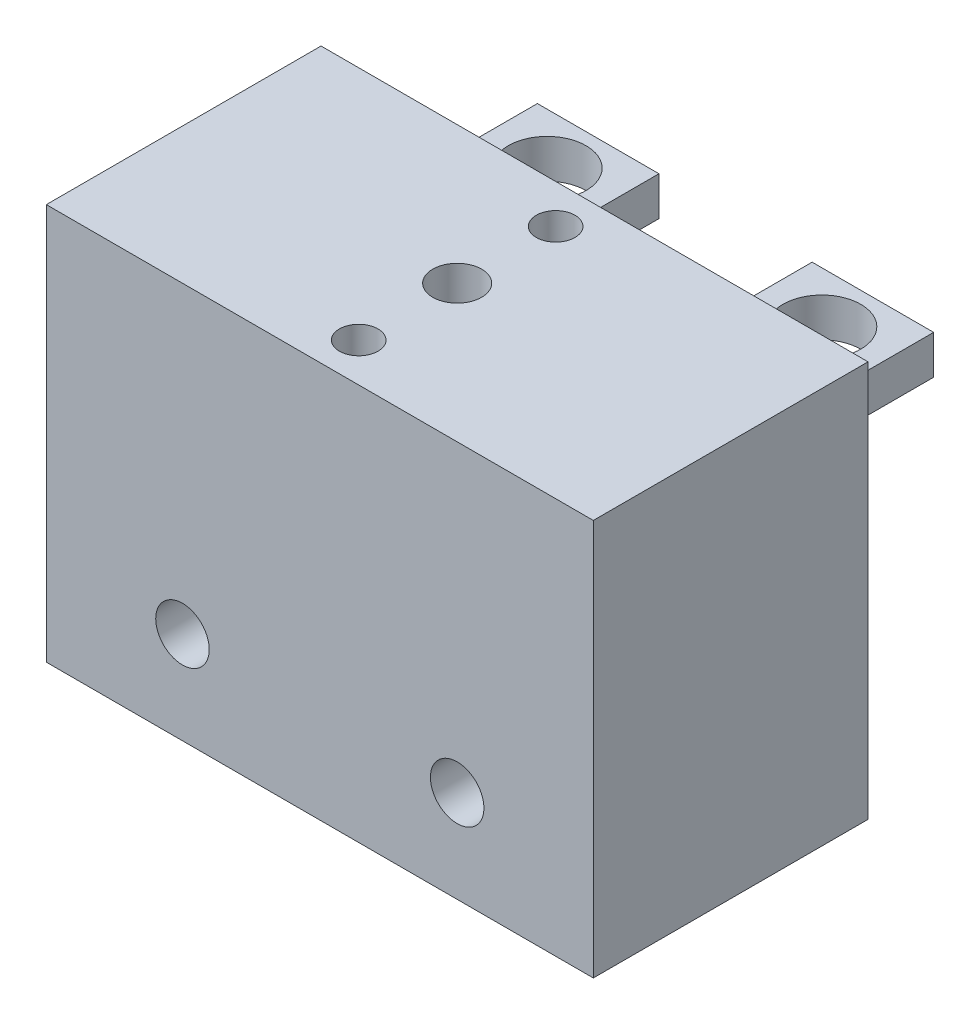
ISO-10303-21;
HEADER;
FILE_DESCRIPTION(('STEP AP214'),'2;1');
FILE_NAME('part.step','',(''),(''),'','','');
FILE_SCHEMA(('AUTOMOTIVE_DESIGN { 1 0 10303 214 1 1 1 1 }'));
ENDSEC;
DATA;
#1=APPLICATION_CONTEXT('core data for automotive mechanical design processes');
#2=APPLICATION_PROTOCOL_DEFINITION('international standard','automotive_design',2000,#1);
#3=PRODUCT_CONTEXT('',#1,'mechanical');
#4=PRODUCT('Part','Part','',(#3));
#5=PRODUCT_RELATED_PRODUCT_CATEGORY('part','',(#4));
#6=PRODUCT_DEFINITION_FORMATION('','',#4);
#7=PRODUCT_DEFINITION_CONTEXT('part definition',#1,'design');
#8=PRODUCT_DEFINITION('design','',#6,#7);
#9=PRODUCT_DEFINITION_SHAPE('','',#8);
#10=(LENGTH_UNIT() NAMED_UNIT(*) SI_UNIT(.MILLI.,.METRE.));
#11=(NAMED_UNIT(*) PLANE_ANGLE_UNIT() SI_UNIT($,.RADIAN.));
#12=(NAMED_UNIT(*) SI_UNIT($,.STERADIAN.) SOLID_ANGLE_UNIT());
#13=UNCERTAINTY_MEASURE_WITH_UNIT(LENGTH_MEASURE(1.E-05),#10,'distance_accuracy_value','');
#14=(GEOMETRIC_REPRESENTATION_CONTEXT(3) GLOBAL_UNCERTAINTY_ASSIGNED_CONTEXT((#13)) GLOBAL_UNIT_ASSIGNED_CONTEXT((#10,
#11,#12)) REPRESENTATION_CONTEXT('',''));
#15=CARTESIAN_POINT('',(0.,0.,0.));
#16=DIRECTION('',(0.,0.,1.));
#17=DIRECTION('',(1.,0.,0.));
#18=AXIS2_PLACEMENT_3D('',#15,#16,#17);
#19=CARTESIAN_POINT('',(0.,41.402,-28.702));
#20=DIRECTION('',(0.,0.,1.));
#21=DIRECTION('',(1.,0.,0.));
#22=AXIS2_PLACEMENT_3D('',#19,#20,#21);
#23=PLANE('',#22);
#24=DIRECTION('',(0.,-1.,0.));
#25=VECTOR('',#24,1.);
#26=CARTESIAN_POINT('',(49.276,32.766,-28.702));
#27=LINE('',#26,#25);
#28=CARTESIAN_POINT('',(49.276,32.766,-28.702));
#29=VERTEX_POINT('',#28);
#30=CARTESIAN_POINT('',(49.276,28.702,-28.702));
#31=VERTEX_POINT('',#30);
#32=EDGE_CURVE('E152',#29,#31,#27,.T.);
#33=ORIENTED_EDGE('',*,*,#32,.F.);
#34=DIRECTION('',(1.,0.,0.));
#35=VECTOR('',#34,1.);
#36=CARTESIAN_POINT('',(49.276,32.766,-28.702));
#37=LINE('',#36,#35);
#38=CARTESIAN_POINT('',(36.576,32.766,-28.702));
#39=VERTEX_POINT('',#38);
#40=EDGE_CURVE('E161',#39,#29,#37,.T.);
#41=ORIENTED_EDGE('',*,*,#40,.F.);
#42=DIRECTION('',(0.,1.,0.));
#43=VECTOR('',#42,1.);
#44=CARTESIAN_POINT('',(36.576,32.766,-28.702));
#45=LINE('',#44,#43);
#46=CARTESIAN_POINT('',(36.576,28.702,-28.702));
#47=VERTEX_POINT('',#46);
#48=EDGE_CURVE('E158',#47,#39,#45,.T.);
#49=ORIENTED_EDGE('',*,*,#48,.F.);
#50=DIRECTION('',(-1.,0.,0.));
#51=VECTOR('',#50,1.);
#52=CARTESIAN_POINT('',(49.276,28.702,-28.702));
#53=LINE('',#52,#51);
#54=EDGE_CURVE('E155',#31,#47,#53,.T.);
#55=ORIENTED_EDGE('',*,*,#54,.F.);
#56=EDGE_LOOP('',(#33,#41,#49,#55));
#57=FACE_BOUND('',#56,.T.);
#58=CARTESIAN_POINT('',(14.224,9.65199999999999,-28.702));
#59=DIRECTION('',(0.,0.,-1.));
#60=DIRECTION('',(-1.,0.,0.));
#61=AXIS2_PLACEMENT_3D('',#58,#59,#60);
#62=CIRCLE('',#61,2.794);
#63=CARTESIAN_POINT('',(11.43,9.65199999999999,-28.702));
#64=VERTEX_POINT('',#63);
#65=EDGE_CURVE('E185',#64,#64,#62,.T.);
#66=ORIENTED_EDGE('',*,*,#65,.F.);
#67=EDGE_LOOP('',(#66));
#68=FACE_BOUND('',#67,.T.);
#69=CARTESIAN_POINT('',(42.926,9.65199999999999,-28.702));
#70=DIRECTION('',(0.,0.,-1.));
#71=DIRECTION('',(-1.,0.,0.));
#72=AXIS2_PLACEMENT_3D('',#69,#70,#71);
#73=CIRCLE('',#72,2.794);
#74=CARTESIAN_POINT('',(40.132,9.65199999999999,-28.702));
#75=VERTEX_POINT('',#74);
#76=EDGE_CURVE('E191',#75,#75,#73,.T.);
#77=ORIENTED_EDGE('',*,*,#76,.F.);
#78=EDGE_LOOP('',(#77));
#79=FACE_BOUND('',#78,.T.);
#80=DIRECTION('',(-1.,0.,0.));
#81=VECTOR('',#80,1.);
#82=CARTESIAN_POINT('',(0.,0.,-28.702));
#83=LINE('',#82,#81);
#84=CARTESIAN_POINT('',(57.15,0.,-28.702));
#85=VERTEX_POINT('',#84);
#86=CARTESIAN_POINT('',(0.,0.,-28.702));
#87=VERTEX_POINT('',#86);
#88=EDGE_CURVE('E222',#85,#87,#83,.T.);
#89=ORIENTED_EDGE('',*,*,#88,.T.);
#90=DIRECTION('',(0.,-1.,0.));
#91=VECTOR('',#90,1.);
#92=CARTESIAN_POINT('',(0.,41.402,-28.702));
#93=LINE('',#92,#91);
#94=CARTESIAN_POINT('',(0.,41.402,-28.702));
#95=VERTEX_POINT('',#94);
#96=EDGE_CURVE('E233',#95,#87,#93,.T.);
#97=ORIENTED_EDGE('',*,*,#96,.F.);
#98=DIRECTION('',(-1.,0.,0.));
#99=VECTOR('',#98,1.);
#100=CARTESIAN_POINT('',(0.,41.402,-28.702));
#101=LINE('',#100,#99);
#102=CARTESIAN_POINT('',(57.15,41.402,-28.702));
#103=VERTEX_POINT('',#102);
#104=EDGE_CURVE('E231',#103,#95,#101,.T.);
#105=ORIENTED_EDGE('',*,*,#104,.F.);
#106=DIRECTION('',(0.,-1.,0.));
#107=VECTOR('',#106,1.);
#108=CARTESIAN_POINT('',(57.15,41.402,-28.702));
#109=LINE('',#108,#107);
#110=EDGE_CURVE('E236',#103,#85,#109,.T.);
#111=ORIENTED_EDGE('',*,*,#110,.T.);
#112=EDGE_LOOP('',(#89,#97,#105,#111));
#113=FACE_BOUND('',#112,.T.);
#114=DIRECTION('',(0.,-1.,0.));
#115=VECTOR('',#114,1.);
#116=CARTESIAN_POINT('',(20.574,32.766,-28.702));
#117=LINE('',#116,#115);
#118=CARTESIAN_POINT('',(20.574,32.766,-28.702));
#119=VERTEX_POINT('',#118);
#120=CARTESIAN_POINT('',(20.574,28.702,-28.702));
#121=VERTEX_POINT('',#120);
#122=EDGE_CURVE('E119',#119,#121,#117,.T.);
#123=ORIENTED_EDGE('',*,*,#122,.F.);
#124=DIRECTION('',(1.,0.,0.));
#125=VECTOR('',#124,1.);
#126=CARTESIAN_POINT('',(20.574,32.766,-28.702));
#127=LINE('',#126,#125);
#128=CARTESIAN_POINT('',(7.874,32.766,-28.702));
#129=VERTEX_POINT('',#128);
#130=EDGE_CURVE('E121',#129,#119,#127,.T.);
#131=ORIENTED_EDGE('',*,*,#130,.F.);
#132=DIRECTION('',(0.,1.,0.));
#133=VECTOR('',#132,1.);
#134=CARTESIAN_POINT('',(7.874,32.766,-28.702));
#135=LINE('',#134,#133);
#136=CARTESIAN_POINT('',(7.874,28.702,-28.702));
#137=VERTEX_POINT('',#136);
#138=EDGE_CURVE('E54',#137,#129,#135,.T.);
#139=ORIENTED_EDGE('',*,*,#138,.F.);
#140=DIRECTION('',(-1.,0.,0.));
#141=VECTOR('',#140,1.);
#142=CARTESIAN_POINT('',(20.574,28.702,-28.702));
#143=LINE('',#142,#141);
#144=EDGE_CURVE('E49',#121,#137,#143,.T.);
#145=ORIENTED_EDGE('',*,*,#144,.F.);
#146=EDGE_LOOP('',(#123,#131,#139,#145));
#147=FACE_BOUND('',#146,.T.);
#148=ADVANCED_FACE('F34',(#57,#68,#79,#113,#147),#23,.F.);
#149=CARTESIAN_POINT('',(0.,41.402,0.));
#150=DIRECTION('',(1.,0.,0.));
#151=DIRECTION('',(0.,0.,-1.));
#152=AXIS2_PLACEMENT_3D('',#149,#150,#151);
#153=PLANE('',#152);
#154=DIRECTION('',(0.,0.,1.));
#155=VECTOR('',#154,1.);
#156=CARTESIAN_POINT('',(0.,0.,0.));
#157=LINE('',#156,#155);
#158=CARTESIAN_POINT('',(0.,0.,0.));
#159=VERTEX_POINT('',#158);
#160=EDGE_CURVE('E215',#87,#159,#157,.T.);
#161=ORIENTED_EDGE('',*,*,#160,.T.);
#162=DIRECTION('',(0.,-1.,0.));
#163=VECTOR('',#162,1.);
#164=CARTESIAN_POINT('',(0.,41.402,0.));
#165=LINE('',#164,#163);
#166=CARTESIAN_POINT('',(0.,41.402,0.));
#167=VERTEX_POINT('',#166);
#168=EDGE_CURVE('E11',#167,#159,#165,.T.);
#169=ORIENTED_EDGE('',*,*,#168,.F.);
#170=DIRECTION('',(0.,0.,1.));
#171=VECTOR('',#170,1.);
#172=CARTESIAN_POINT('',(0.,41.402,0.));
#173=LINE('',#172,#171);
#174=EDGE_CURVE('E224',#95,#167,#173,.T.);
#175=ORIENTED_EDGE('',*,*,#174,.F.);
#176=ORIENTED_EDGE('',*,*,#96,.T.);
#177=EDGE_LOOP('',(#161,#169,#175,#176));
#178=FACE_BOUND('',#177,.T.);
#179=ADVANCED_FACE('F36',(#178),#153,.F.);
#180=CARTESIAN_POINT('',(0.,41.402,0.));
#181=DIRECTION('',(0.,0.,-1.));
#182=DIRECTION('',(-1.,0.,0.));
#183=AXIS2_PLACEMENT_3D('',#180,#181,#182);
#184=PLANE('',#183);
#185=CARTESIAN_POINT('',(14.224,9.65199999999999,0.));
#186=DIRECTION('',(0.,0.,-1.));
#187=DIRECTION('',(-1.,0.,0.));
#188=AXIS2_PLACEMENT_3D('',#185,#186,#187);
#189=CIRCLE('',#188,2.794);
#190=CARTESIAN_POINT('',(11.43,9.65199999999999,0.));
#191=VERTEX_POINT('',#190);
#192=EDGE_CURVE('E188',#191,#191,#189,.T.);
#193=ORIENTED_EDGE('',*,*,#192,.T.);
#194=EDGE_LOOP('',(#193));
#195=FACE_BOUND('',#194,.T.);
#196=CARTESIAN_POINT('',(42.926,9.65199999999999,0.));
#197=DIRECTION('',(0.,0.,-1.));
#198=DIRECTION('',(-1.,0.,0.));
#199=AXIS2_PLACEMENT_3D('',#196,#197,#198);
#200=CIRCLE('',#199,2.794);
#201=CARTESIAN_POINT('',(40.132,9.65199999999999,0.));
#202=VERTEX_POINT('',#201);
#203=EDGE_CURVE('E194',#202,#202,#200,.T.);
#204=ORIENTED_EDGE('',*,*,#203,.T.);
#205=EDGE_LOOP('',(#204));
#206=FACE_BOUND('',#205,.T.);
#207=DIRECTION('',(1.,0.,0.));
#208=VECTOR('',#207,1.);
#209=CARTESIAN_POINT('',(0.,0.,0.));
#210=LINE('',#209,#208);
#211=CARTESIAN_POINT('',(57.15,0.,0.));
#212=VERTEX_POINT('',#211);
#213=EDGE_CURVE('E218',#159,#212,#210,.T.);
#214=ORIENTED_EDGE('',*,*,#213,.T.);
#215=DIRECTION('',(0.,-1.,0.));
#216=VECTOR('',#215,1.);
#217=CARTESIAN_POINT('',(57.15,41.402,0.));
#218=LINE('',#217,#216);
#219=CARTESIAN_POINT('',(57.15,41.402,0.));
#220=VERTEX_POINT('',#219);
#221=EDGE_CURVE('E42',#220,#212,#218,.T.);
#222=ORIENTED_EDGE('',*,*,#221,.F.);
#223=DIRECTION('',(1.,0.,0.));
#224=VECTOR('',#223,1.);
#225=CARTESIAN_POINT('',(0.,41.402,0.));
#226=LINE('',#225,#224);
#227=EDGE_CURVE('E227',#167,#220,#226,.T.);
#228=ORIENTED_EDGE('',*,*,#227,.F.);
#229=ORIENTED_EDGE('',*,*,#168,.T.);
#230=EDGE_LOOP('',(#214,#222,#228,#229));
#231=FACE_BOUND('',#230,.T.);
#232=ADVANCED_FACE('F258',(#195,#206,#231),#184,.F.);
#233=CARTESIAN_POINT('',(57.15,41.402,0.));
#234=DIRECTION('',(-1.,0.,0.));
#235=DIRECTION('',(0.,0.,1.));
#236=AXIS2_PLACEMENT_3D('',#233,#234,#235);
#237=PLANE('',#236);
#238=DIRECTION('',(0.,0.,-1.));
#239=VECTOR('',#238,1.);
#240=CARTESIAN_POINT('',(57.15,0.,0.));
#241=LINE('',#240,#239);
#242=EDGE_CURVE('E220',#212,#85,#241,.T.);
#243=ORIENTED_EDGE('',*,*,#242,.T.);
#244=ORIENTED_EDGE('',*,*,#110,.F.);
#245=DIRECTION('',(0.,0.,-1.));
#246=VECTOR('',#245,1.);
#247=CARTESIAN_POINT('',(57.15,41.402,0.));
#248=LINE('',#247,#246);
#249=EDGE_CURVE('E229',#220,#103,#248,.T.);
#250=ORIENTED_EDGE('',*,*,#249,.F.);
#251=ORIENTED_EDGE('',*,*,#221,.T.);
#252=EDGE_LOOP('',(#243,#244,#250,#251));
#253=FACE_BOUND('',#252,.T.);
#254=ADVANCED_FACE('F243',(#253),#237,.F.);
#255=CARTESIAN_POINT('',(0.,41.402,-28.702));
#256=DIRECTION('',(0.,-1.,0.));
#257=DIRECTION('',(0.,0.,-1.));
#258=AXIS2_PLACEMENT_3D('',#255,#256,#257);
#259=PLANE('',#258);
#260=CARTESIAN_POINT('',(28.575,41.402,-4.06399999999999));
#261=DIRECTION('',(0.,1.,0.));
#262=DIRECTION('',(0.,0.,1.));
#263=AXIS2_PLACEMENT_3D('',#260,#261,#262);
#264=CIRCLE('',#263,2.0193);
#265=CARTESIAN_POINT('',(28.575,41.402,-2.04469999999999));
#266=VERTEX_POINT('',#265);
#267=EDGE_CURVE('E197',#266,#266,#264,.T.);
#268=ORIENTED_EDGE('',*,*,#267,.F.);
#269=EDGE_LOOP('',(#268));
#270=FACE_BOUND('',#269,.T.);
#271=CARTESIAN_POINT('',(28.575,41.402,-24.638));
#272=DIRECTION('',(0.,1.,0.));
#273=DIRECTION('',(0.,0.,1.));
#274=AXIS2_PLACEMENT_3D('',#271,#272,#273);
#275=CIRCLE('',#274,2.0193);
#276=CARTESIAN_POINT('',(28.575,41.402,-22.6187));
#277=VERTEX_POINT('',#276);
#278=EDGE_CURVE('E203',#277,#277,#275,.T.);
#279=ORIENTED_EDGE('',*,*,#278,.F.);
#280=EDGE_LOOP('',(#279));
#281=FACE_BOUND('',#280,.T.);
#282=CARTESIAN_POINT('',(28.575,41.402,-14.351));
#283=DIRECTION('',(0.,1.,0.));
#284=DIRECTION('',(0.,0.,1.));
#285=AXIS2_PLACEMENT_3D('',#282,#283,#284);
#286=CIRCLE('',#285,2.5527);
#287=CARTESIAN_POINT('',(28.575,41.402,-11.7983));
#288=VERTEX_POINT('',#287);
#289=EDGE_CURVE('E209',#288,#288,#286,.T.);
#290=ORIENTED_EDGE('',*,*,#289,.F.);
#291=EDGE_LOOP('',(#290));
#292=FACE_BOUND('',#291,.T.);
#293=ORIENTED_EDGE('',*,*,#174,.T.);
#294=ORIENTED_EDGE('',*,*,#227,.T.);
#295=ORIENTED_EDGE('',*,*,#249,.T.);
#296=ORIENTED_EDGE('',*,*,#104,.T.);
#297=EDGE_LOOP('',(#293,#294,#295,#296));
#298=FACE_BOUND('',#297,.T.);
#299=ADVANCED_FACE('F257',(#270,#281,#292,#298),#259,.F.);
#300=CARTESIAN_POINT('',(0.,0.,-28.702));
#301=DIRECTION('',(0.,-1.,0.));
#302=DIRECTION('',(0.,0.,-1.));
#303=AXIS2_PLACEMENT_3D('',#300,#301,#302);
#304=PLANE('',#303);
#305=CARTESIAN_POINT('',(28.575,0.,-14.351));
#306=DIRECTION('',(0.,1.,0.));
#307=DIRECTION('',(0.,0.,1.));
#308=AXIS2_PLACEMENT_3D('',#305,#306,#307);
#309=CIRCLE('',#308,2.5527);
#310=CARTESIAN_POINT('',(28.575,0.,-11.7983));
#311=VERTEX_POINT('',#310);
#312=EDGE_CURVE('E212',#311,#311,#309,.T.);
#313=ORIENTED_EDGE('',*,*,#312,.T.);
#314=EDGE_LOOP('',(#313));
#315=FACE_BOUND('',#314,.T.);
#316=ORIENTED_EDGE('',*,*,#160,.F.);
#317=ORIENTED_EDGE('',*,*,#88,.F.);
#318=ORIENTED_EDGE('',*,*,#242,.F.);
#319=ORIENTED_EDGE('',*,*,#213,.F.);
#320=EDGE_LOOP('',(#316,#317,#318,#319));
#321=FACE_BOUND('',#320,.T.);
#322=ADVANCED_FACE('F249',(#315,#321),#304,.T.);
#323=CARTESIAN_POINT('',(28.575,0.,-14.351));
#324=DIRECTION('',(0.,1.,0.));
#325=DIRECTION('',(0.,0.,1.));
#326=AXIS2_PLACEMENT_3D('',#323,#324,#325);
#327=CYLINDRICAL_SURFACE('',#326,2.5527);
#328=ORIENTED_EDGE('',*,*,#312,.F.);
#329=EDGE_LOOP('',(#328));
#330=FACE_BOUND('',#329,.T.);
#331=ORIENTED_EDGE('',*,*,#289,.T.);
#332=EDGE_LOOP('',(#331));
#333=FACE_BOUND('',#332,.T.);
#334=ADVANCED_FACE('F279',(#330,#333),#327,.F.);
#335=CARTESIAN_POINT('',(28.575,16.002,-24.638));
#336=DIRECTION('',(0.,1.,0.));
#337=DIRECTION('',(0.,0.,1.));
#338=AXIS2_PLACEMENT_3D('',#335,#336,#337);
#339=CYLINDRICAL_SURFACE('',#338,2.0193);
#340=CARTESIAN_POINT('',(28.575,16.002,-24.638));
#341=DIRECTION('',(0.,1.,0.));
#342=DIRECTION('',(0.,0.,1.));
#343=AXIS2_PLACEMENT_3D('',#340,#341,#342);
#344=CIRCLE('',#343,2.0193);
#345=CARTESIAN_POINT('',(28.575,16.002,-22.6187));
#346=VERTEX_POINT('',#345);
#347=EDGE_CURVE('E206',#346,#346,#344,.T.);
#348=ORIENTED_EDGE('',*,*,#347,.F.);
#349=EDGE_LOOP('',(#348));
#350=FACE_BOUND('',#349,.T.);
#351=ORIENTED_EDGE('',*,*,#278,.T.);
#352=EDGE_LOOP('',(#351));
#353=FACE_BOUND('',#352,.T.);
#354=ADVANCED_FACE('F283',(#350,#353),#339,.F.);
#355=CARTESIAN_POINT('',(28.575,16.002,-24.638));
#356=DIRECTION('',(0.,1.,0.));
#357=DIRECTION('',(0.,0.,1.));
#358=AXIS2_PLACEMENT_3D('',#355,#356,#357);
#359=PLANE('',#358);
#360=ORIENTED_EDGE('',*,*,#347,.T.);
#361=EDGE_LOOP('',(#360));
#362=FACE_BOUND('',#361,.T.);
#363=ADVANCED_FACE('F287',(#362),#359,.T.);
#364=CARTESIAN_POINT('',(28.575,16.002,-4.06399999999999));
#365=DIRECTION('',(0.,1.,0.));
#366=DIRECTION('',(0.,0.,1.));
#367=AXIS2_PLACEMENT_3D('',#364,#365,#366);
#368=CYLINDRICAL_SURFACE('',#367,2.0193);
#369=CARTESIAN_POINT('',(28.575,16.002,-4.06399999999999));
#370=DIRECTION('',(0.,1.,0.));
#371=DIRECTION('',(0.,0.,1.));
#372=AXIS2_PLACEMENT_3D('',#369,#370,#371);
#373=CIRCLE('',#372,2.0193);
#374=CARTESIAN_POINT('',(28.575,16.002,-2.04469999999999));
#375=VERTEX_POINT('',#374);
#376=EDGE_CURVE('E200',#375,#375,#373,.T.);
#377=ORIENTED_EDGE('',*,*,#376,.F.);
#378=EDGE_LOOP('',(#377));
#379=FACE_BOUND('',#378,.T.);
#380=ORIENTED_EDGE('',*,*,#267,.T.);
#381=EDGE_LOOP('',(#380));
#382=FACE_BOUND('',#381,.T.);
#383=ADVANCED_FACE('F291',(#379,#382),#368,.F.);
#384=CARTESIAN_POINT('',(28.575,16.002,-4.06399999999999));
#385=DIRECTION('',(0.,1.,0.));
#386=DIRECTION('',(0.,0.,1.));
#387=AXIS2_PLACEMENT_3D('',#384,#385,#386);
#388=PLANE('',#387);
#389=ORIENTED_EDGE('',*,*,#376,.T.);
#390=EDGE_LOOP('',(#389));
#391=FACE_BOUND('',#390,.T.);
#392=ADVANCED_FACE('F295',(#391),#388,.T.);
#393=CARTESIAN_POINT('',(42.926,9.65199999999999,0.));
#394=DIRECTION('',(0.,0.,-1.));
#395=DIRECTION('',(-1.,0.,0.));
#396=AXIS2_PLACEMENT_3D('',#393,#394,#395);
#397=CYLINDRICAL_SURFACE('',#396,2.794);
#398=ORIENTED_EDGE('',*,*,#203,.F.);
#399=EDGE_LOOP('',(#398));
#400=FACE_BOUND('',#399,.T.);
#401=ORIENTED_EDGE('',*,*,#76,.T.);
#402=EDGE_LOOP('',(#401));
#403=FACE_BOUND('',#402,.T.);
#404=ADVANCED_FACE('F299',(#400,#403),#397,.F.);
#405=CARTESIAN_POINT('',(14.224,9.65199999999999,0.));
#406=DIRECTION('',(0.,0.,-1.));
#407=DIRECTION('',(-1.,0.,0.));
#408=AXIS2_PLACEMENT_3D('',#405,#406,#407);
#409=CYLINDRICAL_SURFACE('',#408,2.794);
#410=ORIENTED_EDGE('',*,*,#192,.F.);
#411=EDGE_LOOP('',(#410));
#412=FACE_BOUND('',#411,.T.);
#413=ORIENTED_EDGE('',*,*,#65,.T.);
#414=EDGE_LOOP('',(#413));
#415=FACE_BOUND('',#414,.T.);
#416=ADVANCED_FACE('F303',(#412,#415),#409,.F.);
#417=CARTESIAN_POINT('',(49.276,32.766,-43.434));
#418=DIRECTION('',(-1.,0.,0.));
#419=DIRECTION('',(0.,-1.,0.));
#420=AXIS2_PLACEMENT_3D('',#417,#418,#419);
#421=PLANE('',#420);
#422=ORIENTED_EDGE('',*,*,#32,.T.);
#423=DIRECTION('',(0.,0.,1.));
#424=VECTOR('',#423,1.);
#425=CARTESIAN_POINT('',(49.276,28.702,-43.434));
#426=LINE('',#425,#424);
#427=CARTESIAN_POINT('',(49.276,28.702,-43.434));
#428=VERTEX_POINT('',#427);
#429=EDGE_CURVE('E182',#428,#31,#426,.T.);
#430=ORIENTED_EDGE('',*,*,#429,.F.);
#431=DIRECTION('',(0.,-1.,0.));
#432=VECTOR('',#431,1.);
#433=CARTESIAN_POINT('',(49.276,32.766,-43.434));
#434=LINE('',#433,#432);
#435=CARTESIAN_POINT('',(49.276,32.766,-43.434));
#436=VERTEX_POINT('',#435);
#437=EDGE_CURVE('E164',#436,#428,#434,.T.);
#438=ORIENTED_EDGE('',*,*,#437,.F.);
#439=DIRECTION('',(0.,0.,1.));
#440=VECTOR('',#439,1.);
#441=CARTESIAN_POINT('',(49.276,32.766,-43.434));
#442=LINE('',#441,#440);
#443=EDGE_CURVE('E173',#436,#29,#442,.T.);
#444=ORIENTED_EDGE('',*,*,#443,.T.);
#445=EDGE_LOOP('',(#422,#430,#438,#444));
#446=FACE_BOUND('',#445,.T.);
#447=ADVANCED_FACE('F307',(#446),#421,.F.);
#448=CARTESIAN_POINT('',(49.276,28.702,-43.434));
#449=DIRECTION('',(0.,1.,0.));
#450=DIRECTION('',(-1.,0.,0.));
#451=AXIS2_PLACEMENT_3D('',#448,#449,#450);
#452=PLANE('',#451);
#453=CARTESIAN_POINT('',(42.926,28.702,-38.1));
#454=DIRECTION('',(0.,1.,0.));
#455=DIRECTION('',(-1.,0.,0.));
#456=AXIS2_PLACEMENT_3D('',#453,#454,#455);
#457=CIRCLE('',#456,4.064);
#458=CARTESIAN_POINT('',(38.862,28.702,-38.1));
#459=VERTEX_POINT('',#458);
#460=EDGE_CURVE('E125',#459,#459,#457,.T.);
#461=ORIENTED_EDGE('',*,*,#460,.T.);
#462=EDGE_LOOP('',(#461));
#463=FACE_BOUND('',#462,.T.);
#464=ORIENTED_EDGE('',*,*,#54,.T.);
#465=DIRECTION('',(0.,0.,1.));
#466=VECTOR('',#465,1.);
#467=CARTESIAN_POINT('',(36.576,28.702,-43.434));
#468=LINE('',#467,#466);
#469=CARTESIAN_POINT('',(36.576,28.702,-43.434));
#470=VERTEX_POINT('',#469);
#471=EDGE_CURVE('E179',#470,#47,#468,.T.);
#472=ORIENTED_EDGE('',*,*,#471,.F.);
#473=DIRECTION('',(-1.,0.,0.));
#474=VECTOR('',#473,1.);
#475=CARTESIAN_POINT('',(49.276,28.702,-43.434));
#476=LINE('',#475,#474);
#477=EDGE_CURVE('E167',#428,#470,#476,.T.);
#478=ORIENTED_EDGE('',*,*,#477,.F.);
#479=ORIENTED_EDGE('',*,*,#429,.T.);
#480=EDGE_LOOP('',(#464,#472,#478,#479));
#481=FACE_BOUND('',#480,.T.);
#482=ADVANCED_FACE('F311',(#463,#481),#452,.F.);
#483=CARTESIAN_POINT('',(36.576,32.766,-43.434));
#484=DIRECTION('',(1.,0.,0.));
#485=DIRECTION('',(0.,1.,0.));
#486=AXIS2_PLACEMENT_3D('',#483,#484,#485);
#487=PLANE('',#486);
#488=ORIENTED_EDGE('',*,*,#48,.T.);
#489=DIRECTION('',(0.,0.,1.));
#490=VECTOR('',#489,1.);
#491=CARTESIAN_POINT('',(36.576,32.766,-43.434));
#492=LINE('',#491,#490);
#493=CARTESIAN_POINT('',(36.576,32.766,-43.434));
#494=VERTEX_POINT('',#493);
#495=EDGE_CURVE('E176',#494,#39,#492,.T.);
#496=ORIENTED_EDGE('',*,*,#495,.F.);
#497=DIRECTION('',(0.,1.,0.));
#498=VECTOR('',#497,1.);
#499=CARTESIAN_POINT('',(36.576,32.766,-43.434));
#500=LINE('',#499,#498);
#501=EDGE_CURVE('E169',#470,#494,#500,.T.);
#502=ORIENTED_EDGE('',*,*,#501,.F.);
#503=ORIENTED_EDGE('',*,*,#471,.T.);
#504=EDGE_LOOP('',(#488,#496,#502,#503));
#505=FACE_BOUND('',#504,.T.);
#506=ADVANCED_FACE('F315',(#505),#487,.F.);
#507=CARTESIAN_POINT('',(49.276,32.766,-43.434));
#508=DIRECTION('',(0.,-1.,0.));
#509=DIRECTION('',(0.,0.,-1.));
#510=AXIS2_PLACEMENT_3D('',#507,#508,#509);
#511=PLANE('',#510);
#512=CARTESIAN_POINT('',(42.926,32.766,-38.1));
#513=DIRECTION('',(0.,1.,0.));
#514=DIRECTION('',(-1.,0.,0.));
#515=AXIS2_PLACEMENT_3D('',#512,#513,#514);
#516=CIRCLE('',#515,4.064);
#517=CARTESIAN_POINT('',(38.862,32.766,-38.1));
#518=VERTEX_POINT('',#517);
#519=EDGE_CURVE('E361',#518,#518,#516,.T.);
#520=ORIENTED_EDGE('',*,*,#519,.F.);
#521=EDGE_LOOP('',(#520));
#522=FACE_BOUND('',#521,.T.);
#523=ORIENTED_EDGE('',*,*,#40,.T.);
#524=ORIENTED_EDGE('',*,*,#443,.F.);
#525=DIRECTION('',(1.,0.,0.));
#526=VECTOR('',#525,1.);
#527=CARTESIAN_POINT('',(49.276,32.766,-43.434));
#528=LINE('',#527,#526);
#529=EDGE_CURVE('E171',#494,#436,#528,.T.);
#530=ORIENTED_EDGE('',*,*,#529,.F.);
#531=ORIENTED_EDGE('',*,*,#495,.T.);
#532=EDGE_LOOP('',(#523,#524,#530,#531));
#533=FACE_BOUND('',#532,.T.);
#534=ADVANCED_FACE('F319',(#522,#533),#511,.F.);
#535=CARTESIAN_POINT('',(49.276,28.702,-43.434));
#536=DIRECTION('',(0.,0.,-1.));
#537=DIRECTION('',(-1.,0.,0.));
#538=AXIS2_PLACEMENT_3D('',#535,#536,#537);
#539=PLANE('',#538);
#540=ORIENTED_EDGE('',*,*,#437,.T.);
#541=ORIENTED_EDGE('',*,*,#477,.T.);
#542=ORIENTED_EDGE('',*,*,#501,.T.);
#543=ORIENTED_EDGE('',*,*,#529,.T.);
#544=EDGE_LOOP('',(#540,#541,#542,#543));
#545=FACE_BOUND('',#544,.T.);
#546=ADVANCED_FACE('F323',(#545),#539,.T.);
#547=CARTESIAN_POINT('',(20.574,32.766,-43.434));
#548=DIRECTION('',(-1.,0.,0.));
#549=DIRECTION('',(0.,-1.,0.));
#550=AXIS2_PLACEMENT_3D('',#547,#548,#549);
#551=PLANE('',#550);
#552=ORIENTED_EDGE('',*,*,#122,.T.);
#553=DIRECTION('',(0.,0.,1.));
#554=VECTOR('',#553,1.);
#555=CARTESIAN_POINT('',(20.574,28.702,-43.434));
#556=LINE('',#555,#554);
#557=CARTESIAN_POINT('',(20.574,28.702,-43.434));
#558=VERTEX_POINT('',#557);
#559=EDGE_CURVE('E150',#558,#121,#556,.T.);
#560=ORIENTED_EDGE('',*,*,#559,.F.);
#561=DIRECTION('',(0.,-1.,0.));
#562=VECTOR('',#561,1.);
#563=CARTESIAN_POINT('',(20.574,32.766,-43.434));
#564=LINE('',#563,#562);
#565=CARTESIAN_POINT('',(20.574,32.766,-43.434));
#566=VERTEX_POINT('',#565);
#567=EDGE_CURVE('E136',#566,#558,#564,.T.);
#568=ORIENTED_EDGE('',*,*,#567,.F.);
#569=DIRECTION('',(0.,0.,1.));
#570=VECTOR('',#569,1.);
#571=CARTESIAN_POINT('',(20.574,32.766,-43.434));
#572=LINE('',#571,#570);
#573=EDGE_CURVE('E132',#566,#119,#572,.T.);
#574=ORIENTED_EDGE('',*,*,#573,.T.);
#575=EDGE_LOOP('',(#552,#560,#568,#574));
#576=FACE_BOUND('',#575,.T.);
#577=ADVANCED_FACE('F138',(#576),#551,.F.);
#578=CARTESIAN_POINT('',(20.574,28.702,-43.434));
#579=DIRECTION('',(0.,1.,0.));
#580=DIRECTION('',(-1.,0.,0.));
#581=AXIS2_PLACEMENT_3D('',#578,#579,#580);
#582=PLANE('',#581);
#583=CARTESIAN_POINT('',(14.224,28.702,-38.1));
#584=DIRECTION('',(0.,1.,0.));
#585=DIRECTION('',(-1.,0.,0.));
#586=AXIS2_PLACEMENT_3D('',#583,#584,#585);
#587=CIRCLE('',#586,4.064);
#588=CARTESIAN_POINT('',(10.16,28.702,-38.1));
#589=VERTEX_POINT('',#588);
#590=EDGE_CURVE('E360',#589,#589,#587,.T.);
#591=ORIENTED_EDGE('',*,*,#590,.T.);
#592=EDGE_LOOP('',(#591));
#593=FACE_BOUND('',#592,.T.);
#594=ORIENTED_EDGE('',*,*,#144,.T.);
#595=DIRECTION('',(0.,0.,1.));
#596=VECTOR('',#595,1.);
#597=CARTESIAN_POINT('',(7.874,28.702,-43.434));
#598=LINE('',#597,#596);
#599=CARTESIAN_POINT('',(7.874,28.702,-43.434));
#600=VERTEX_POINT('',#599);
#601=EDGE_CURVE('E142',#600,#137,#598,.T.);
#602=ORIENTED_EDGE('',*,*,#601,.F.);
#603=DIRECTION('',(-1.,0.,0.));
#604=VECTOR('',#603,1.);
#605=CARTESIAN_POINT('',(20.574,28.702,-43.434));
#606=LINE('',#605,#604);
#607=EDGE_CURVE('E372',#558,#600,#606,.T.);
#608=ORIENTED_EDGE('',*,*,#607,.F.);
#609=ORIENTED_EDGE('',*,*,#559,.T.);
#610=EDGE_LOOP('',(#594,#602,#608,#609));
#611=FACE_BOUND('',#610,.T.);
#612=ADVANCED_FACE('F330',(#593,#611),#582,.F.);
#613=CARTESIAN_POINT('',(7.874,32.766,-43.434));
#614=DIRECTION('',(1.,0.,0.));
#615=DIRECTION('',(0.,1.,0.));
#616=AXIS2_PLACEMENT_3D('',#613,#614,#615);
#617=PLANE('',#616);
#618=ORIENTED_EDGE('',*,*,#138,.T.);
#619=DIRECTION('',(0.,0.,1.));
#620=VECTOR('',#619,1.);
#621=CARTESIAN_POINT('',(7.874,32.766,-43.434));
#622=LINE('',#621,#620);
#623=CARTESIAN_POINT('',(7.874,32.766,-43.434));
#624=VERTEX_POINT('',#623);
#625=EDGE_CURVE('E135',#624,#129,#622,.T.);
#626=ORIENTED_EDGE('',*,*,#625,.F.);
#627=DIRECTION('',(0.,1.,0.));
#628=VECTOR('',#627,1.);
#629=CARTESIAN_POINT('',(7.874,32.766,-43.434));
#630=LINE('',#629,#628);
#631=EDGE_CURVE('E144',#600,#624,#630,.T.);
#632=ORIENTED_EDGE('',*,*,#631,.F.);
#633=ORIENTED_EDGE('',*,*,#601,.T.);
#634=EDGE_LOOP('',(#618,#626,#632,#633));
#635=FACE_BOUND('',#634,.T.);
#636=ADVANCED_FACE('F333',(#635),#617,.F.);
#637=CARTESIAN_POINT('',(20.574,32.766,-43.434));
#638=DIRECTION('',(0.,-1.,0.));
#639=DIRECTION('',(0.,0.,-1.));
#640=AXIS2_PLACEMENT_3D('',#637,#638,#639);
#641=PLANE('',#640);
#642=CARTESIAN_POINT('',(14.224,32.766,-38.1));
#643=DIRECTION('',(0.,1.,0.));
#644=DIRECTION('',(-1.,0.,0.));
#645=AXIS2_PLACEMENT_3D('',#642,#643,#644);
#646=CIRCLE('',#645,4.064);
#647=CARTESIAN_POINT('',(10.16,32.766,-38.1));
#648=VERTEX_POINT('',#647);
#649=EDGE_CURVE('E357',#648,#648,#646,.T.);
#650=ORIENTED_EDGE('',*,*,#649,.F.);
#651=EDGE_LOOP('',(#650));
#652=FACE_BOUND('',#651,.T.);
#653=ORIENTED_EDGE('',*,*,#130,.T.);
#654=ORIENTED_EDGE('',*,*,#573,.F.);
#655=DIRECTION('',(1.,0.,0.));
#656=VECTOR('',#655,1.);
#657=CARTESIAN_POINT('',(20.574,32.766,-43.434));
#658=LINE('',#657,#656);
#659=EDGE_CURVE('E140',#624,#566,#658,.T.);
#660=ORIENTED_EDGE('',*,*,#659,.F.);
#661=ORIENTED_EDGE('',*,*,#625,.T.);
#662=EDGE_LOOP('',(#653,#654,#660,#661));
#663=FACE_BOUND('',#662,.T.);
#664=ADVANCED_FACE('F130',(#652,#663),#641,.F.);
#665=CARTESIAN_POINT('',(20.574,28.702,-43.434));
#666=DIRECTION('',(0.,0.,-1.));
#667=DIRECTION('',(-1.,0.,0.));
#668=AXIS2_PLACEMENT_3D('',#665,#666,#667);
#669=PLANE('',#668);
#670=ORIENTED_EDGE('',*,*,#567,.T.);
#671=ORIENTED_EDGE('',*,*,#607,.T.);
#672=ORIENTED_EDGE('',*,*,#631,.T.);
#673=ORIENTED_EDGE('',*,*,#659,.T.);
#674=EDGE_LOOP('',(#670,#671,#672,#673));
#675=FACE_BOUND('',#674,.T.);
#676=ADVANCED_FACE('F340',(#675),#669,.T.);
#677=CARTESIAN_POINT('',(42.926,0.,-38.1));
#678=DIRECTION('',(0.,1.,0.));
#679=DIRECTION('',(-1.,0.,0.));
#680=AXIS2_PLACEMENT_3D('',#677,#678,#679);
#681=CYLINDRICAL_SURFACE('',#680,4.064);
#682=ORIENTED_EDGE('',*,*,#519,.T.);
#683=EDGE_LOOP('',(#682));
#684=FACE_BOUND('',#683,.T.);
#685=ORIENTED_EDGE('',*,*,#460,.F.);
#686=EDGE_LOOP('',(#685));
#687=FACE_BOUND('',#686,.T.);
#688=ADVANCED_FACE('F344',(#684,#687),#681,.F.);
#689=CARTESIAN_POINT('',(14.224,0.,-38.1));
#690=DIRECTION('',(0.,1.,0.));
#691=DIRECTION('',(-1.,0.,0.));
#692=AXIS2_PLACEMENT_3D('',#689,#690,#691);
#693=CYLINDRICAL_SURFACE('',#692,4.064);
#694=ORIENTED_EDGE('',*,*,#649,.T.);
#695=EDGE_LOOP('',(#694));
#696=FACE_BOUND('',#695,.T.);
#697=ORIENTED_EDGE('',*,*,#590,.F.);
#698=EDGE_LOOP('',(#697));
#699=FACE_BOUND('',#698,.T.);
#700=ADVANCED_FACE('F348',(#696,#699),#693,.F.);
#701=CLOSED_SHELL('',(#148,#179,#232,#254,#299,#322,#334,#354,#363,#383,#392,#404,#416,#447,
#482,#506,#534,#546,#577,#612,#636,#664,#676,#688,#700));
#702=MANIFOLD_SOLID_BREP('B2',#701);
#703=ADVANCED_BREP_SHAPE_REPRESENTATION('',(#18,#702),#14);
#704=SHAPE_DEFINITION_REPRESENTATION(#9,#703);
ENDSEC;
END-ISO-10303-21;
